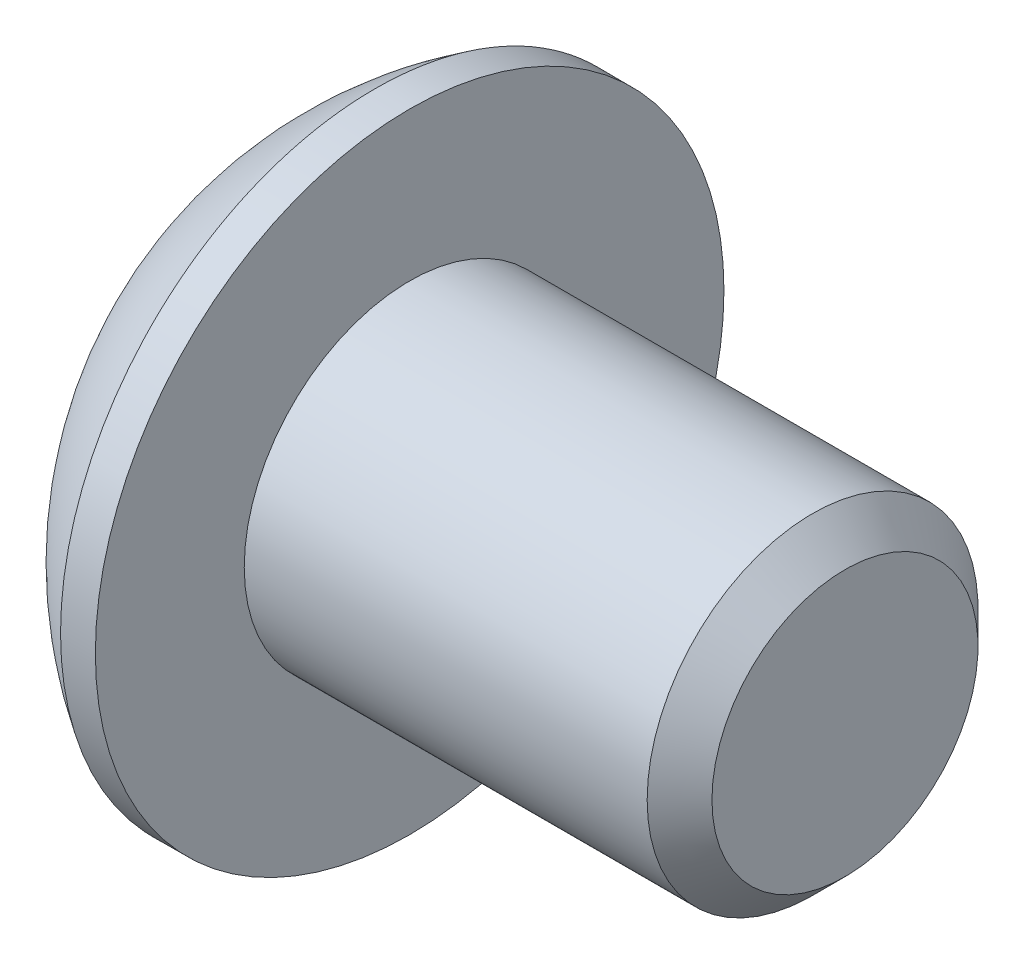
ISO-10303-21;
HEADER;
FILE_DESCRIPTION(('STEP AP214'),'2;1');
FILE_NAME('part.step','',(''),(''),'','','');
FILE_SCHEMA(('AUTOMOTIVE_DESIGN { 1 0 10303 214 1 1 1 1 }'));
ENDSEC;
DATA;
#1=APPLICATION_CONTEXT('core data for automotive mechanical design processes');
#2=APPLICATION_PROTOCOL_DEFINITION('international standard','automotive_design',2000,#1);
#3=PRODUCT_CONTEXT('',#1,'mechanical');
#4=PRODUCT('Part','Part','',(#3));
#5=PRODUCT_RELATED_PRODUCT_CATEGORY('part','',(#4));
#6=PRODUCT_DEFINITION_FORMATION('','',#4);
#7=PRODUCT_DEFINITION_CONTEXT('part definition',#1,'design');
#8=PRODUCT_DEFINITION('design','',#6,#7);
#9=PRODUCT_DEFINITION_SHAPE('','',#8);
#10=(LENGTH_UNIT() NAMED_UNIT(*) SI_UNIT(.MILLI.,.METRE.));
#11=(NAMED_UNIT(*) PLANE_ANGLE_UNIT() SI_UNIT($,.RADIAN.));
#12=(NAMED_UNIT(*) SI_UNIT($,.STERADIAN.) SOLID_ANGLE_UNIT());
#13=UNCERTAINTY_MEASURE_WITH_UNIT(LENGTH_MEASURE(1.E-05),#10,'distance_accuracy_value','');
#14=(GEOMETRIC_REPRESENTATION_CONTEXT(3) GLOBAL_UNCERTAINTY_ASSIGNED_CONTEXT((#13)) GLOBAL_UNIT_ASSIGNED_CONTEXT((#10,
#11,#12)) REPRESENTATION_CONTEXT('',''));
#15=CARTESIAN_POINT('',(0.,0.,0.));
#16=DIRECTION('',(0.,0.,1.));
#17=DIRECTION('',(1.,0.,0.));
#18=AXIS2_PLACEMENT_3D('',#15,#16,#17);
#19=CARTESIAN_POINT('',(1.77800000000006,0.,0.));
#20=DIRECTION('',(-1.,0.,0.));
#21=DIRECTION('',(0.,0.,1.));
#22=AXIS2_PLACEMENT_3D('',#19,#20,#21);
#23=CONICAL_SURFACE('',#22,1.58750000000007,1.04719755119647);
#24=CARTESIAN_POINT('',(2.69454355233878,0.,0.));
#25=VERTEX_POINT('',#24);
#26=VERTEX_LOOP('',#25);
#27=FACE_BOUND('',#26,.T.);
#28=CARTESIAN_POINT('',(1.77800000000006,0.,0.));
#29=DIRECTION('',(-1.,0.,0.));
#30=DIRECTION('',(0.,0.,1.));
#31=AXIS2_PLACEMENT_3D('',#28,#29,#30);
#32=CIRCLE('',#31,1.58750000000007);
#33=CARTESIAN_POINT('',(1.77800000000003,0.,1.58750000000004));
#34=VERTEX_POINT('',#33);
#35=CARTESIAN_POINT('',(1.77800000000003,-1.37481532850783,0.793750000000017));
#36=VERTEX_POINT('',#35);
#37=EDGE_CURVE('E20',#34,#36,#32,.F.);
#38=ORIENTED_EDGE('',*,*,#37,.F.);
#39=CARTESIAN_POINT('',(1.77800000000006,0.,0.));
#40=DIRECTION('',(-1.,0.,0.));
#41=DIRECTION('',(0.,0.,1.));
#42=AXIS2_PLACEMENT_3D('',#39,#40,#41);
#43=CIRCLE('',#42,1.58750000000007);
#44=CARTESIAN_POINT('',(1.77800000000003,1.37481532850783,0.793750000000019));
#45=VERTEX_POINT('',#44);
#46=EDGE_CURVE('E91',#34,#45,#43,.T.);
#47=ORIENTED_EDGE('',*,*,#46,.T.);
#48=CARTESIAN_POINT('',(1.77800000000006,0.,0.));
#49=DIRECTION('',(-1.,0.,0.));
#50=DIRECTION('',(0.,0.,1.));
#51=AXIS2_PLACEMENT_3D('',#48,#49,#50);
#52=CIRCLE('',#51,1.58750000000007);
#53=CARTESIAN_POINT('',(1.77800000000003,1.37481532850783,-0.793750000000019));
#54=VERTEX_POINT('',#53);
#55=EDGE_CURVE('E106',#45,#54,#52,.T.);
#56=ORIENTED_EDGE('',*,*,#55,.T.);
#57=CARTESIAN_POINT('',(1.77800000000006,0.,0.));
#58=DIRECTION('',(-1.,0.,0.));
#59=DIRECTION('',(0.,0.,1.));
#60=AXIS2_PLACEMENT_3D('',#57,#58,#59);
#61=CIRCLE('',#60,1.58750000000007);
#62=CARTESIAN_POINT('',(1.77800000000003,-2.78602967841758E-12,-1.58750000000004));
#63=VERTEX_POINT('',#62);
#64=EDGE_CURVE('E470',#54,#63,#61,.T.);
#65=ORIENTED_EDGE('',*,*,#64,.T.);
#66=CARTESIAN_POINT('',(1.77800000000006,0.,0.));
#67=DIRECTION('',(-1.,0.,0.));
#68=DIRECTION('',(0.,0.,1.));
#69=AXIS2_PLACEMENT_3D('',#66,#67,#68);
#70=CIRCLE('',#69,1.58750000000007);
#71=CARTESIAN_POINT('',(1.77800000000003,-1.37481532850783,-0.793750000000017));
#72=VERTEX_POINT('',#71);
#73=EDGE_CURVE('E471',#72,#63,#70,.F.);
#74=ORIENTED_EDGE('',*,*,#73,.F.);
#75=CARTESIAN_POINT('',(1.77800000000006,0.,0.));
#76=DIRECTION('',(-1.,0.,0.));
#77=DIRECTION('',(0.,0.,1.));
#78=AXIS2_PLACEMENT_3D('',#75,#76,#77);
#79=CIRCLE('',#78,1.58750000000007);
#80=EDGE_CURVE('E94',#36,#72,#79,.F.);
#81=ORIENTED_EDGE('',*,*,#80,.F.);
#82=EDGE_LOOP('',(#38,#47,#56,#65,#74,#81));
#83=FACE_BOUND('',#82,.T.);
#84=ADVANCED_FACE('F17',(#27,#83),#23,.F.);
#85=CARTESIAN_POINT('',(1.778,-2.74963065701559,-1.5875));
#86=DIRECTION('',(1.,0.,0.));
#87=DIRECTION('',(0.,0.,-1.));
#88=AXIS2_PLACEMENT_3D('',#85,#86,#87);
#89=PLANE('',#88);
#90=DIRECTION('',(0.,0.5,0.866025403784439));
#91=VECTOR('',#90,1.);
#92=CARTESIAN_POINT('',(1.778,-1.83308710467706,0.));
#93=LINE('',#92,#91);
#94=CARTESIAN_POINT('',(1.778,-0.91654355233853,1.5875));
#95=VERTEX_POINT('',#94);
#96=EDGE_CURVE('E118',#95,#36,#93,.F.);
#97=ORIENTED_EDGE('',*,*,#96,.F.);
#98=DIRECTION('',(0.,1.,0.));
#99=VECTOR('',#98,1.);
#100=CARTESIAN_POINT('',(1.778,-0.91654355233853,1.5875));
#101=LINE('',#100,#99);
#102=EDGE_CURVE('E112',#34,#95,#101,.F.);
#103=ORIENTED_EDGE('',*,*,#102,.F.);
#104=ORIENTED_EDGE('',*,*,#37,.T.);
#105=EDGE_LOOP('',(#97,#103,#104));
#106=FACE_BOUND('',#105,.T.);
#107=ADVANCED_FACE('F116',(#106),#89,.F.);
#108=CARTESIAN_POINT('',(1.778,-2.74963065701559,-1.5875));
#109=DIRECTION('',(1.,0.,0.));
#110=DIRECTION('',(0.,0.,-1.));
#111=AXIS2_PLACEMENT_3D('',#108,#109,#110);
#112=PLANE('',#111);
#113=DIRECTION('',(0.,-0.5,0.866025403784439));
#114=VECTOR('',#113,1.);
#115=CARTESIAN_POINT('',(1.778,-0.91654355233853,-1.5875));
#116=LINE('',#115,#114);
#117=CARTESIAN_POINT('',(1.778,-1.83308710467706,0.));
#118=VERTEX_POINT('',#117);
#119=EDGE_CURVE('E447',#118,#72,#116,.F.);
#120=ORIENTED_EDGE('',*,*,#119,.F.);
#121=DIRECTION('',(0.,0.5,0.866025403784439));
#122=VECTOR('',#121,1.);
#123=CARTESIAN_POINT('',(1.778,-1.83308710467706,0.));
#124=LINE('',#123,#122);
#125=EDGE_CURVE('E120',#36,#118,#124,.F.);
#126=ORIENTED_EDGE('',*,*,#125,.F.);
#127=ORIENTED_EDGE('',*,*,#80,.T.);
#128=EDGE_LOOP('',(#120,#126,#127));
#129=FACE_BOUND('',#128,.T.);
#130=ADVANCED_FACE('F190',(#129),#112,.F.);
#131=CARTESIAN_POINT('',(1.778,-2.74963065701559,-1.5875));
#132=DIRECTION('',(1.,0.,0.));
#133=DIRECTION('',(0.,0.,-1.));
#134=AXIS2_PLACEMENT_3D('',#131,#132,#133);
#135=PLANE('',#134);
#136=DIRECTION('',(0.,1.,0.));
#137=VECTOR('',#136,1.);
#138=CARTESIAN_POINT('',(1.778,0.916543552338532,-1.5875));
#139=LINE('',#138,#137);
#140=CARTESIAN_POINT('',(1.778,-0.91654355233853,-1.5875));
#141=VERTEX_POINT('',#140);
#142=EDGE_CURVE('E433',#141,#63,#139,.T.);
#143=ORIENTED_EDGE('',*,*,#142,.F.);
#144=DIRECTION('',(0.,-0.5,0.866025403784439));
#145=VECTOR('',#144,1.);
#146=CARTESIAN_POINT('',(1.778,-0.91654355233853,-1.5875));
#147=LINE('',#146,#145);
#148=EDGE_CURVE('E445',#72,#141,#147,.F.);
#149=ORIENTED_EDGE('',*,*,#148,.F.);
#150=ORIENTED_EDGE('',*,*,#73,.T.);
#151=EDGE_LOOP('',(#143,#149,#150));
#152=FACE_BOUND('',#151,.T.);
#153=ADVANCED_FACE('F186',(#152),#135,.F.);
#154=CARTESIAN_POINT('',(1.778,-2.74963065701559,-1.5875));
#155=DIRECTION('',(1.,0.,0.));
#156=DIRECTION('',(0.,0.,-1.));
#157=AXIS2_PLACEMENT_3D('',#154,#155,#156);
#158=PLANE('',#157);
#159=DIRECTION('',(0.,-0.5,-0.866025403784439));
#160=VECTOR('',#159,1.);
#161=CARTESIAN_POINT('',(1.778,1.83308710467706,0.));
#162=LINE('',#161,#160);
#163=CARTESIAN_POINT('',(1.778,0.916543552338532,-1.5875));
#164=VERTEX_POINT('',#163);
#165=EDGE_CURVE('E419',#164,#54,#162,.F.);
#166=ORIENTED_EDGE('',*,*,#165,.F.);
#167=DIRECTION('',(0.,1.,0.));
#168=VECTOR('',#167,1.);
#169=CARTESIAN_POINT('',(1.778,0.916543552338532,-1.5875));
#170=LINE('',#169,#168);
#171=EDGE_CURVE('E431',#63,#164,#170,.T.);
#172=ORIENTED_EDGE('',*,*,#171,.F.);
#173=ORIENTED_EDGE('',*,*,#64,.F.);
#174=EDGE_LOOP('',(#166,#172,#173));
#175=FACE_BOUND('',#174,.T.);
#176=ADVANCED_FACE('F182',(#175),#158,.F.);
#177=CARTESIAN_POINT('',(1.778,-2.74963065701559,-1.5875));
#178=DIRECTION('',(1.,0.,0.));
#179=DIRECTION('',(0.,0.,-1.));
#180=AXIS2_PLACEMENT_3D('',#177,#178,#179);
#181=PLANE('',#180);
#182=DIRECTION('',(0.,0.5,-0.866025403784439));
#183=VECTOR('',#182,1.);
#184=CARTESIAN_POINT('',(1.778,0.916543552338533,1.5875));
#185=LINE('',#184,#183);
#186=CARTESIAN_POINT('',(1.778,1.83308710467706,0.));
#187=VERTEX_POINT('',#186);
#188=EDGE_CURVE('E399',#187,#45,#185,.F.);
#189=ORIENTED_EDGE('',*,*,#188,.F.);
#190=DIRECTION('',(0.,-0.5,-0.866025403784439));
#191=VECTOR('',#190,1.);
#192=CARTESIAN_POINT('',(1.778,1.83308710467706,0.));
#193=LINE('',#192,#191);
#194=EDGE_CURVE('E417',#54,#187,#193,.F.);
#195=ORIENTED_EDGE('',*,*,#194,.F.);
#196=ORIENTED_EDGE('',*,*,#55,.F.);
#197=EDGE_LOOP('',(#189,#195,#196));
#198=FACE_BOUND('',#197,.T.);
#199=ADVANCED_FACE('F179',(#198),#181,.F.);
#200=CARTESIAN_POINT('',(1.778,-2.74963065701559,-1.5875));
#201=DIRECTION('',(1.,0.,0.));
#202=DIRECTION('',(0.,0.,-1.));
#203=AXIS2_PLACEMENT_3D('',#200,#201,#202);
#204=PLANE('',#203);
#205=DIRECTION('',(0.,1.,0.));
#206=VECTOR('',#205,1.);
#207=CARTESIAN_POINT('',(1.778,-0.91654355233853,1.5875));
#208=LINE('',#207,#206);
#209=CARTESIAN_POINT('',(1.778,0.916543552338533,1.5875));
#210=VERTEX_POINT('',#209);
#211=EDGE_CURVE('E103',#210,#34,#208,.F.);
#212=ORIENTED_EDGE('',*,*,#211,.F.);
#213=DIRECTION('',(0.,0.5,-0.866025403784439));
#214=VECTOR('',#213,1.);
#215=CARTESIAN_POINT('',(1.778,0.916543552338533,1.5875));
#216=LINE('',#215,#214);
#217=EDGE_CURVE('E105',#45,#210,#216,.F.);
#218=ORIENTED_EDGE('',*,*,#217,.F.);
#219=ORIENTED_EDGE('',*,*,#46,.F.);
#220=EDGE_LOOP('',(#212,#218,#219));
#221=FACE_BOUND('',#220,.T.);
#222=ADVANCED_FACE('F102',(#221),#204,.F.);
#223=CARTESIAN_POINT('',(1.778,-0.91654355233853,1.5875));
#224=DIRECTION('',(0.,0.,-1.));
#225=DIRECTION('',(0.,1.,0.));
#226=AXIS2_PLACEMENT_3D('',#223,#224,#225);
#227=PLANE('',#226);
#228=DIRECTION('',(0.,1.,0.));
#229=VECTOR('',#228,1.);
#230=CARTESIAN_POINT('',(0.,0.,1.5875));
#231=LINE('',#230,#229);
#232=CARTESIAN_POINT('',(0.,0.916543552338532,1.5875));
#233=VERTEX_POINT('',#232);
#234=CARTESIAN_POINT('',(0.,-0.91654355233853,1.5875));
#235=VERTEX_POINT('',#234);
#236=EDGE_CURVE('E396',#233,#235,#231,.F.);
#237=ORIENTED_EDGE('',*,*,#236,.F.);
#238=DIRECTION('',(1.,0.,0.));
#239=VECTOR('',#238,1.);
#240=CARTESIAN_POINT('',(1.778,0.916543552338533,1.5875));
#241=LINE('',#240,#239);
#242=EDGE_CURVE('E114',#210,#233,#241,.F.);
#243=ORIENTED_EDGE('',*,*,#242,.F.);
#244=ORIENTED_EDGE('',*,*,#211,.T.);
#245=ORIENTED_EDGE('',*,*,#102,.T.);
#246=DIRECTION('',(1.,0.,0.));
#247=VECTOR('',#246,1.);
#248=CARTESIAN_POINT('',(1.778,-0.91654355233853,1.5875));
#249=LINE('',#248,#247);
#250=EDGE_CURVE('E452',#235,#95,#249,.T.);
#251=ORIENTED_EDGE('',*,*,#250,.F.);
#252=EDGE_LOOP('',(#237,#243,#244,#245,#251));
#253=FACE_BOUND('',#252,.T.);
#254=ADVANCED_FACE('F110',(#253),#227,.T.);
#255=CARTESIAN_POINT('',(1.778,-1.83308710467706,0.));
#256=DIRECTION('',(0.,0.866025403784439,-0.5));
#257=DIRECTION('',(0.,0.5,0.866025403784439));
#258=AXIS2_PLACEMENT_3D('',#255,#256,#257);
#259=PLANE('',#258);
#260=DIRECTION('',(0.,-0.5,-0.866025403784439));
#261=VECTOR('',#260,1.);
#262=CARTESIAN_POINT('',(0.,-0.91654355233853,1.5875));
#263=LINE('',#262,#261);
#264=CARTESIAN_POINT('',(0.,-1.83308710467706,0.));
#265=VERTEX_POINT('',#264);
#266=EDGE_CURVE('E394',#235,#265,#263,.T.);
#267=ORIENTED_EDGE('',*,*,#266,.F.);
#268=ORIENTED_EDGE('',*,*,#250,.T.);
#269=ORIENTED_EDGE('',*,*,#96,.T.);
#270=ORIENTED_EDGE('',*,*,#125,.T.);
#271=DIRECTION('',(1.,0.,0.));
#272=VECTOR('',#271,1.);
#273=CARTESIAN_POINT('',(1.778,-1.83308710467706,0.));
#274=LINE('',#273,#272);
#275=EDGE_CURVE('E438',#265,#118,#274,.T.);
#276=ORIENTED_EDGE('',*,*,#275,.F.);
#277=EDGE_LOOP('',(#267,#268,#269,#270,#276));
#278=FACE_BOUND('',#277,.T.);
#279=ADVANCED_FACE('F170',(#278),#259,.T.);
#280=CARTESIAN_POINT('',(1.778,-0.91654355233853,-1.5875));
#281=DIRECTION('',(0.,0.866025403784439,0.5));
#282=DIRECTION('',(0.,-0.5,0.866025403784439));
#283=AXIS2_PLACEMENT_3D('',#280,#281,#282);
#284=PLANE('',#283);
#285=DIRECTION('',(0.,0.5,-0.866025403784439));
#286=VECTOR('',#285,1.);
#287=CARTESIAN_POINT('',(0.,-1.83308710467706,0.));
#288=LINE('',#287,#286);
#289=CARTESIAN_POINT('',(0.,-0.91654355233853,-1.5875));
#290=VERTEX_POINT('',#289);
#291=EDGE_CURVE('E392',#265,#290,#288,.T.);
#292=ORIENTED_EDGE('',*,*,#291,.F.);
#293=ORIENTED_EDGE('',*,*,#275,.T.);
#294=ORIENTED_EDGE('',*,*,#119,.T.);
#295=ORIENTED_EDGE('',*,*,#148,.T.);
#296=DIRECTION('',(1.,0.,0.));
#297=VECTOR('',#296,1.);
#298=CARTESIAN_POINT('',(1.778,-0.91654355233853,-1.5875));
#299=LINE('',#298,#297);
#300=EDGE_CURVE('E424',#290,#141,#299,.T.);
#301=ORIENTED_EDGE('',*,*,#300,.F.);
#302=EDGE_LOOP('',(#292,#293,#294,#295,#301));
#303=FACE_BOUND('',#302,.T.);
#304=ADVANCED_FACE('F166',(#303),#284,.T.);
#305=CARTESIAN_POINT('',(1.778,0.916543552338532,-1.5875));
#306=DIRECTION('',(0.,0.,1.));
#307=DIRECTION('',(1.,0.,0.));
#308=AXIS2_PLACEMENT_3D('',#305,#306,#307);
#309=PLANE('',#308);
#310=DIRECTION('',(0.,1.,0.));
#311=VECTOR('',#310,1.);
#312=CARTESIAN_POINT('',(0.,0.,-1.5875));
#313=LINE('',#312,#311);
#314=CARTESIAN_POINT('',(0.,0.916543552338532,-1.5875));
#315=VERTEX_POINT('',#314);
#316=EDGE_CURVE('E390',#290,#315,#313,.T.);
#317=ORIENTED_EDGE('',*,*,#316,.F.);
#318=ORIENTED_EDGE('',*,*,#300,.T.);
#319=ORIENTED_EDGE('',*,*,#142,.T.);
#320=ORIENTED_EDGE('',*,*,#171,.T.);
#321=DIRECTION('',(1.,0.,0.));
#322=VECTOR('',#321,1.);
#323=CARTESIAN_POINT('',(1.778,0.916543552338532,-1.5875));
#324=LINE('',#323,#322);
#325=EDGE_CURVE('E402',#315,#164,#324,.T.);
#326=ORIENTED_EDGE('',*,*,#325,.F.);
#327=EDGE_LOOP('',(#317,#318,#319,#320,#326));
#328=FACE_BOUND('',#327,.T.);
#329=ADVANCED_FACE('F162',(#328),#309,.T.);
#330=CARTESIAN_POINT('',(1.778,1.83308710467706,0.));
#331=DIRECTION('',(0.,-0.866025403784439,0.5));
#332=DIRECTION('',(0.,-0.5,-0.866025403784439));
#333=AXIS2_PLACEMENT_3D('',#330,#331,#332);
#334=PLANE('',#333);
#335=DIRECTION('',(0.,0.5,0.866025403784438));
#336=VECTOR('',#335,1.);
#337=CARTESIAN_POINT('',(0.,0.916543552338532,-1.5875));
#338=LINE('',#337,#336);
#339=CARTESIAN_POINT('',(0.,1.83308710467706,0.));
#340=VERTEX_POINT('',#339);
#341=EDGE_CURVE('E35',#315,#340,#338,.T.);
#342=ORIENTED_EDGE('',*,*,#341,.F.);
#343=ORIENTED_EDGE('',*,*,#325,.T.);
#344=ORIENTED_EDGE('',*,*,#165,.T.);
#345=ORIENTED_EDGE('',*,*,#194,.T.);
#346=DIRECTION('',(1.,0.,0.));
#347=VECTOR('',#346,1.);
#348=CARTESIAN_POINT('',(1.778,1.83308710467706,0.));
#349=LINE('',#348,#347);
#350=EDGE_CURVE('E398',#340,#187,#349,.T.);
#351=ORIENTED_EDGE('',*,*,#350,.F.);
#352=EDGE_LOOP('',(#342,#343,#344,#345,#351));
#353=FACE_BOUND('',#352,.T.);
#354=ADVANCED_FACE('F158',(#353),#334,.T.);
#355=CARTESIAN_POINT('',(1.778,0.916543552338533,1.5875));
#356=DIRECTION('',(0.,-0.866025403784439,-0.5));
#357=DIRECTION('',(0.,0.5,-0.866025403784439));
#358=AXIS2_PLACEMENT_3D('',#355,#356,#357);
#359=PLANE('',#358);
#360=DIRECTION('',(0.,-0.5,0.866025403784439));
#361=VECTOR('',#360,1.);
#362=CARTESIAN_POINT('',(0.,1.83308710467706,0.));
#363=LINE('',#362,#361);
#364=EDGE_CURVE('E143',#340,#233,#363,.T.);
#365=ORIENTED_EDGE('',*,*,#364,.F.);
#366=ORIENTED_EDGE('',*,*,#350,.T.);
#367=ORIENTED_EDGE('',*,*,#188,.T.);
#368=ORIENTED_EDGE('',*,*,#217,.T.);
#369=ORIENTED_EDGE('',*,*,#242,.T.);
#370=EDGE_LOOP('',(#365,#366,#367,#368,#369));
#371=FACE_BOUND('',#370,.T.);
#372=ADVANCED_FACE('F155',(#371),#359,.T.);
#373=CARTESIAN_POINT('',(0.,0.,0.));
#374=DIRECTION('',(-1.,0.,0.));
#375=DIRECTION('',(0.,0.,1.));
#376=AXIS2_PLACEMENT_3D('',#373,#374,#375);
#377=PLANE('',#376);
#378=ORIENTED_EDGE('',*,*,#341,.T.);
#379=ORIENTED_EDGE('',*,*,#364,.T.);
#380=ORIENTED_EDGE('',*,*,#236,.T.);
#381=ORIENTED_EDGE('',*,*,#266,.T.);
#382=ORIENTED_EDGE('',*,*,#291,.T.);
#383=ORIENTED_EDGE('',*,*,#316,.T.);
#384=EDGE_LOOP('',(#378,#379,#380,#381,#382,#383));
#385=FACE_BOUND('',#384,.T.);
#386=CARTESIAN_POINT('',(0.,2.29235,0.));
#387=CARTESIAN_POINT('',(0.,2.29234961429956,0.0643619991867155));
#388=CARTESIAN_POINT('',(0.,2.28963695190107,0.128735826629365));
#389=CARTESIAN_POINT('',(0.,2.27880393843647,0.257038618985286));
#390=CARTESIAN_POINT('',(0.,2.27068199085126,0.320967446929162));
#391=CARTESIAN_POINT('',(0.,2.24906694794255,0.448021254607717));
#392=CARTESIAN_POINT('',(-2.10840056970795E-13,2.2355653265346,0.51114479338186));
#393=CARTESIAN_POINT('',(2.11879226109671E-13,2.20328400495644,0.636065176149321));
#394=CARTESIAN_POINT('',(7.89917625163527E-13,2.18450002159113,0.697860899533934));
#395=CARTESIAN_POINT('',(1.31285126424162E-12,2.12048422735802,0.880329802927747));
#396=CARTESIAN_POINT('',(0.,2.06753599079459,0.998391795928116));
#397=CARTESIAN_POINT('',(0.,1.94254204858672,1.22393765942147));
#398=CARTESIAN_POINT('',(1.0943500696831E-12,1.87049561696642,1.33142112758208));
#399=CARTESIAN_POINT('',(6.78225420709987E-13,1.7497425419488,1.48237719670935));
#400=CARTESIAN_POINT('',(1.81996039545648E-13,1.707345731323,1.53101280076737));
#401=CARTESIAN_POINT('',(-1.80953624347813E-13,1.61863910291529,1.62450601319185));
#402=CARTESIAN_POINT('',(0.,1.57233309727312,1.66936721890417));
#403=CARTESIAN_POINT('',(0.,1.47608431707233,1.7550488420402));
#404=CARTESIAN_POINT('',(0.,1.42613990458994,1.79586741981512));
#405=CARTESIAN_POINT('',(0.,1.3229945254125,1.87315615311522));
#406=CARTESIAN_POINT('',(0.,1.26979280714187,1.90962529930697));
#407=CARTESIAN_POINT('',(0.,1.10588180153952,2.01207722151089));
#408=CARTESIAN_POINT('',(0.,0.990764947001307,2.07119486286666));
#409=CARTESIAN_POINT('',(0.,0.752302198839713,2.16922858468856));
#410=CARTESIAN_POINT('',(0.,0.628956393121256,2.20814488091449));
#411=CARTESIAN_POINT('',(0.,0.377466101733266,2.2647275576592));
#412=CARTESIAN_POINT('',(0.,0.249321590440377,2.28239382469379));
#413=CARTESIAN_POINT('',(0.,-0.00811435371610997,2.29595665980955));
#414=CARTESIAN_POINT('',(0.,-0.137405786579708,2.29185322789072));
#415=CARTESIAN_POINT('',(0.,-0.393449386933728,2.2620096240906));
#416=CARTESIAN_POINT('',(0.,-0.520201567981086,2.23626956775766));
#417=CARTESIAN_POINT('',(0.,-0.767645294384453,2.16383549332687));
#418=CARTESIAN_POINT('',(0.,-0.888336774993558,2.11714125142685));
#419=CARTESIAN_POINT('',(0.,-1.06210572146656,2.03247976453654));
#420=CARTESIAN_POINT('',(0.,-1.11884498714067,2.00180278323695));
#421=CARTESIAN_POINT('',(0.,-1.22954062855573,1.93578011658036));
#422=CARTESIAN_POINT('',(0.,-1.28349764565393,1.9004355139425));
#423=CARTESIAN_POINT('',(0.,-1.38821676641538,1.82534174602347));
#424=CARTESIAN_POINT('',(0.,-1.43898030563029,1.78559458231503));
#425=CARTESIAN_POINT('',(0.,-1.53701984534432,1.70193996292361));
#426=CARTESIAN_POINT('',(0.,-1.58429243280551,1.65802852924127));
#427=CARTESIAN_POINT('',(0.,-1.72023903553759,1.52059650554139));
#428=CARTESIAN_POINT('',(0.,-1.80318066138239,1.42127847626519));
#429=CARTESIAN_POINT('',(0.,-1.95118232345099,1.21011519784664));
#430=CARTESIAN_POINT('',(0.,-2.01624303935585,1.09827042509272));
#431=CARTESIAN_POINT('',(0.,-2.09907772661315,0.923538238005837));
#432=CARTESIAN_POINT('',(0.,-2.12425103063559,0.864058373981965));
#433=CARTESIAN_POINT('',(0.,-2.16947990046566,0.7432215621756));
#434=CARTESIAN_POINT('',(0.,-2.18953960800685,0.681866178863365));
#435=CARTESIAN_POINT('',(0.,-2.22438542051157,0.557786972400357));
#436=CARTESIAN_POINT('',(0.,-2.23917985294819,0.495065478128173));
#437=CARTESIAN_POINT('',(0.,-2.26343456384454,0.368611258323516));
#438=CARTESIAN_POINT('',(0.,-2.27289641559286,0.30487883675957));
#439=CARTESIAN_POINT('',(0.,-2.28388649696737,0.200873029360625));
#440=CARTESIAN_POINT('',(0.,-2.28705930623294,0.160766164180098));
#441=CARTESIAN_POINT('',(0.,-2.29129117827045,0.0804410725432715));
#442=CARTESIAN_POINT('',(0.,-2.29235024104239,0.0402228460869717));
#443=CARTESIAN_POINT('',(0.,-2.29234961429957,-0.0643619991867168));
#444=CARTESIAN_POINT('',(0.,-2.28963695190109,-0.128735826629366));
#445=CARTESIAN_POINT('',(0.,-2.27880393843648,-0.257038618985287));
#446=CARTESIAN_POINT('',(0.,-2.27068199085127,-0.320967446929163));
#447=CARTESIAN_POINT('',(0.,-2.24906694794256,-0.448021254607718));
#448=CARTESIAN_POINT('',(-2.11158505516439E-13,-2.23556532653461,-0.511144793381861));
#449=CARTESIAN_POINT('',(2.12197933617066E-13,-2.20328400495644,-0.636065176149321));
#450=CARTESIAN_POINT('',(7.91271169771705E-13,-2.18450002159114,-0.697860899533935));
#451=CARTESIAN_POINT('',(1.31534652841856E-12,-2.12048422735803,-0.880329802927748));
#452=CARTESIAN_POINT('',(0.,-2.06753599079459,-0.998391795928114));
#453=CARTESIAN_POINT('',(0.,-1.94254204858673,-1.22393765942147));
#454=CARTESIAN_POINT('',(1.09423089153949E-12,-1.87049561696643,-1.33142112758208));
#455=CARTESIAN_POINT('',(6.78285087865736E-13,-1.74974254194881,-1.48237719670935));
#456=CARTESIAN_POINT('',(1.82011279261461E-13,-1.70734573132301,-1.53101280076737));
#457=CARTESIAN_POINT('',(-1.80968849370244E-13,-1.61863910291529,-1.62450601319185));
#458=CARTESIAN_POINT('',(0.,-1.57233309727313,-1.66936721890417));
#459=CARTESIAN_POINT('',(0.,-1.47608431707234,-1.7550488420402));
#460=CARTESIAN_POINT('',(0.,-1.42613990458995,-1.79586741981512));
#461=CARTESIAN_POINT('',(0.,-1.32299452541251,-1.87315615311522));
#462=CARTESIAN_POINT('',(0.,-1.26979280714188,-1.90962529930696));
#463=CARTESIAN_POINT('',(0.,-1.10588180153952,-2.01207722151089));
#464=CARTESIAN_POINT('',(0.,-0.990764947001314,-2.07119486286666));
#465=CARTESIAN_POINT('',(0.,-0.752302198839721,-2.16922858468856));
#466=CARTESIAN_POINT('',(0.,-0.628956393121265,-2.2081448809145));
#467=CARTESIAN_POINT('',(0.,-0.377466101733274,-2.2647275576592));
#468=CARTESIAN_POINT('',(0.,-0.249321590440385,-2.28239382469379));
#469=CARTESIAN_POINT('',(0.,0.0081143537161019,-2.29595665980955));
#470=CARTESIAN_POINT('',(0.,0.1374057865797,-2.29185322789072));
#471=CARTESIAN_POINT('',(0.,0.39344938693372,-2.2620096240906));
#472=CARTESIAN_POINT('',(0.,0.520201567981077,-2.23626956775766));
#473=CARTESIAN_POINT('',(0.,0.767645294384445,-2.16383549332687));
#474=CARTESIAN_POINT('',(0.,0.88833677499355,-2.11714125142685));
#475=CARTESIAN_POINT('',(0.,1.06210572146656,-2.03247976453654));
#476=CARTESIAN_POINT('',(0.,1.11884498714066,-2.00180278323695));
#477=CARTESIAN_POINT('',(0.,1.22954062855572,-1.93578011658036));
#478=CARTESIAN_POINT('',(0.,1.28349764565392,-1.9004355139425));
#479=CARTESIAN_POINT('',(0.,1.38821676641537,-1.82534174602348));
#480=CARTESIAN_POINT('',(0.,1.43898030563028,-1.78559458231503));
#481=CARTESIAN_POINT('',(0.,1.53701984534431,-1.70193996292361));
#482=CARTESIAN_POINT('',(0.,1.5842924328055,-1.65802852924127));
#483=CARTESIAN_POINT('',(0.,1.72023903553758,-1.52059650554139));
#484=CARTESIAN_POINT('',(0.,1.80318066138238,-1.42127847626519));
#485=CARTESIAN_POINT('',(0.,1.95118232345098,-1.21011519784664));
#486=CARTESIAN_POINT('',(0.,2.01624303935584,-1.09827042509272));
#487=CARTESIAN_POINT('',(0.,2.09907772661315,-0.923538238005838));
#488=CARTESIAN_POINT('',(0.,2.12425103063558,-0.864058373981966));
#489=CARTESIAN_POINT('',(0.,2.16947990046565,-0.7432215621756));
#490=CARTESIAN_POINT('',(0.,2.18953960800684,-0.681866178863365));
#491=CARTESIAN_POINT('',(0.,2.22438542051156,-0.557786972400357));
#492=CARTESIAN_POINT('',(0.,2.23917985294818,-0.495065478128172));
#493=CARTESIAN_POINT('',(0.,2.26343456384453,-0.368611258323515));
#494=CARTESIAN_POINT('',(0.,2.27289641559286,-0.304878836759569));
#495=CARTESIAN_POINT('',(0.,2.28388649696736,-0.200873029360625));
#496=CARTESIAN_POINT('',(0.,2.28705930623293,-0.160766164180098));
#497=CARTESIAN_POINT('',(0.,2.29129117827044,-0.0804410725432719));
#498=CARTESIAN_POINT('',(0.,2.29235024104238,-0.0402228460869725));
#499=CARTESIAN_POINT('',(0.,2.29235,0.));
#500=B_SPLINE_CURVE_WITH_KNOTS('',3,(#386,#387,#388,#389,#390,#391,#392,#393,#394,#395,#396,
#397,#398,#399,#400,#401,#402,#403,#404,#405,#406,#407,#408,#409,#410,#411,#412,#413,#414,#415,
#416,#417,#418,#419,#420,#421,#422,#423,#424,#425,#426,#427,#428,#429,#430,#431,#432,#433,#434,
#435,#436,#437,#438,#439,#440,#441,#442,#443,#444,#445,#446,#447,#448,#449,#450,#451,#452,#453,
#454,#455,#456,#457,#458,#459,#460,#461,#462,#463,#464,#465,#466,#467,#468,#469,#470,#471,#472,
#473,#474,#475,#476,#477,#478,#479,#480,#481,#482,#483,#484,#485,#486,#487,#488,#489,#490,#491,
#492,#493,#494,#495,#496,#497,#498,#499),.UNSPECIFIED.,.T.,.F.,(4,2,2,2,2,2,2,2,2,2,2,2,2,2,2,2,
2,2,2,2,2,2,2,2,2,2,2,2,2,2,2,2,2,2,2,2,2,2,2,2,2,2,2,2,2,2,2,2,2,2,2,2,2,2,2,2,4),(0.,
0.193048968618033,0.386154939782395,0.579568183995958,0.773138711491038,1.15935703864577,
1.54559004914645,1.73895960916368,1.93214273180063,2.12541336477221,2.31872876140888,
2.70495649282618,3.09118009906583,3.47740576789431,3.86363143672285,4.24985504296253,
4.63608277437979,4.82939817101619,5.02266880398748,5.2158519266242,5.40922148664122,
5.79545449714217,6.18167282429724,6.37524335179261,6.56865659600641,6.76176256717089,
6.95481153578908,7.07545693291922,7.19610233004937,7.3891512986674,7.58225726983176,
7.77567051404533,7.96924104154041,8.35545936869514,8.74169237919581,8.93506193921305,
9.12824506185,9.32151569482158,9.51483109145825,9.90105882287555,10.2872824291152,
10.6735080979437,11.0597337667722,11.4459573730119,11.8321851044292,12.0255005010656,
12.2187711340368,12.4119542566736,12.6053238166906,12.9915568271915,13.3777751543466,
13.571345681842,13.7647589260558,13.9578648972203,14.1509138658384,14.2715592629686,
14.3922046600987),.UNSPECIFIED.);
#501=CARTESIAN_POINT('',(0.,2.29235,0.));
#502=VERTEX_POINT('',#501);
#503=EDGE_CURVE('E137',#502,#502,#500,.T.);
#504=ORIENTED_EDGE('',*,*,#503,.F.);
#505=EDGE_LOOP('',(#504));
#506=FACE_BOUND('',#505,.T.);
#507=ADVANCED_FACE('F150',(#385,#506),#377,.T.);
#508=CARTESIAN_POINT('',(8.9154,0.,0.));
#509=DIRECTION('',(-1.,0.,0.));
#510=DIRECTION('',(0.,0.,1.));
#511=AXIS2_PLACEMENT_3D('',#508,#509,#510);
#512=PLANE('',#511);
#513=CARTESIAN_POINT('',(8.91539999992119,0.,0.));
#514=DIRECTION('',(-1.,0.,0.));
#515=DIRECTION('',(0.,0.,1.));
#516=AXIS2_PLACEMENT_3D('',#513,#514,#515);
#517=CIRCLE('',#516,1.94056000003684);
#518=CARTESIAN_POINT('',(8.91539999992119,0.,1.94056000003684));
#519=VERTEX_POINT('',#518);
#520=EDGE_CURVE('E134',#519,#519,#517,.T.);
#521=ORIENTED_EDGE('',*,*,#520,.F.);
#522=EDGE_LOOP('',(#521));
#523=FACE_BOUND('',#522,.T.);
#524=ADVANCED_FACE('F154',(#523),#512,.F.);
#525=CARTESIAN_POINT('',(4.85989606481482,0.,0.));
#526=DIRECTION('',(0.,1.,0.));
#527=DIRECTION('',(1.,0.,0.));
#528=AXIS2_PLACEMENT_3D('',#525,#526,#527);
#529=SPHERICAL_SURFACE('',#528,5.37340285883187);
#530=CARTESIAN_POINT('',(2.0574,0.,0.));
#531=DIRECTION('',(-1.,0.,0.));
#532=DIRECTION('',(0.,0.,1.));
#533=AXIS2_PLACEMENT_3D('',#530,#531,#532);
#534=CIRCLE('',#533,4.5847);
#535=CARTESIAN_POINT('',(2.0574,0.,4.5847));
#536=VERTEX_POINT('',#535);
#537=EDGE_CURVE('E131',#536,#536,#534,.F.);
#538=ORIENTED_EDGE('',*,*,#537,.F.);
#539=EDGE_LOOP('',(#538));
#540=FACE_BOUND('',#539,.T.);
#541=ORIENTED_EDGE('',*,*,#503,.T.);
#542=EDGE_LOOP('',(#541));
#543=FACE_BOUND('',#542,.T.);
#544=ADVANCED_FACE('F145',(#540,#543),#529,.T.);
#545=CARTESIAN_POINT('',(8.44296000008171,0.,0.));
#546=DIRECTION('',(-1.,0.,0.));
#547=DIRECTION('',(0.,0.,1.));
#548=AXIS2_PLACEMENT_3D('',#545,#546,#547);
#549=CONICAL_SURFACE('',#548,2.41299999987632,0.785398163397448);
#550=CARTESIAN_POINT('',(8.44296000000003,0.,0.));
#551=DIRECTION('',(-1.,0.,0.));
#552=DIRECTION('',(0.,0.,1.));
#553=AXIS2_PLACEMENT_3D('',#550,#551,#552);
#554=CIRCLE('',#553,2.41299999999999);
#555=CARTESIAN_POINT('',(8.44296000000003,0.,2.41299999999999));
#556=VERTEX_POINT('',#555);
#557=EDGE_CURVE('E130',#556,#556,#554,.T.);
#558=ORIENTED_EDGE('',*,*,#557,.F.);
#559=EDGE_LOOP('',(#558));
#560=FACE_BOUND('',#559,.T.);
#561=ORIENTED_EDGE('',*,*,#520,.T.);
#562=EDGE_LOOP('',(#561));
#563=FACE_BOUND('',#562,.T.);
#564=ADVANCED_FACE('F215',(#560,#563),#549,.T.);
#565=CARTESIAN_POINT('',(0.,0.,0.));
#566=DIRECTION('',(-1.,0.,0.));
#567=DIRECTION('',(0.,0.,1.));
#568=AXIS2_PLACEMENT_3D('',#565,#566,#567);
#569=CYLINDRICAL_SURFACE('',#568,4.5847);
#570=ORIENTED_EDGE('',*,*,#537,.T.);
#571=EDGE_LOOP('',(#570));
#572=FACE_BOUND('',#571,.T.);
#573=CARTESIAN_POINT('',(2.5654,0.,0.));
#574=DIRECTION('',(-1.,0.,0.));
#575=DIRECTION('',(0.,0.,1.));
#576=AXIS2_PLACEMENT_3D('',#573,#574,#575);
#577=CIRCLE('',#576,4.5847);
#578=CARTESIAN_POINT('',(2.5654,0.,4.5847));
#579=VERTEX_POINT('',#578);
#580=EDGE_CURVE('E26',#579,#579,#577,.T.);
#581=ORIENTED_EDGE('',*,*,#580,.T.);
#582=EDGE_LOOP('',(#581));
#583=FACE_BOUND('',#582,.T.);
#584=ADVANCED_FACE('F208',(#572,#583),#569,.T.);
#585=CARTESIAN_POINT('',(0.,0.,0.));
#586=DIRECTION('',(-1.,0.,0.));
#587=DIRECTION('',(0.,0.,1.));
#588=AXIS2_PLACEMENT_3D('',#585,#586,#587);
#589=CYLINDRICAL_SURFACE('',#588,2.41299999999999);
#590=CARTESIAN_POINT('',(2.5654,0.,0.));
#591=DIRECTION('',(-1.,0.,0.));
#592=DIRECTION('',(0.,0.,1.));
#593=AXIS2_PLACEMENT_3D('',#590,#591,#592);
#594=CIRCLE('',#593,2.41299999999999);
#595=CARTESIAN_POINT('',(2.5654,0.,2.41299999999999));
#596=VERTEX_POINT('',#595);
#597=EDGE_CURVE('E11',#596,#596,#594,.F.);
#598=ORIENTED_EDGE('',*,*,#597,.T.);
#599=EDGE_LOOP('',(#598));
#600=FACE_BOUND('',#599,.T.);
#601=ORIENTED_EDGE('',*,*,#557,.T.);
#602=EDGE_LOOP('',(#601));
#603=FACE_BOUND('',#602,.T.);
#604=ADVANCED_FACE('F202',(#600,#603),#589,.T.);
#605=CARTESIAN_POINT('',(2.5654,2.41299999999999,0.));
#606=DIRECTION('',(-1.,0.,0.));
#607=DIRECTION('',(0.,0.,1.));
#608=AXIS2_PLACEMENT_3D('',#605,#606,#607);
#609=PLANE('',#608);
#610=ORIENTED_EDGE('',*,*,#597,.F.);
#611=EDGE_LOOP('',(#610));
#612=FACE_BOUND('',#611,.T.);
#613=ORIENTED_EDGE('',*,*,#580,.F.);
#614=EDGE_LOOP('',(#613));
#615=FACE_BOUND('',#614,.T.);
#616=ADVANCED_FACE('F200',(#612,#615),#609,.F.);
#617=CLOSED_SHELL('',(#84,#107,#130,#153,#176,#199,#222,#254,#279,#304,#329,#354,#372,#507,#524,
#544,#564,#584,#604,#616));
#618=MANIFOLD_SOLID_BREP('B1',#617);
#619=ADVANCED_BREP_SHAPE_REPRESENTATION('',(#18,#618),#14);
#620=SHAPE_DEFINITION_REPRESENTATION(#9,#619);
ENDSEC;
END-ISO-10303-21;
